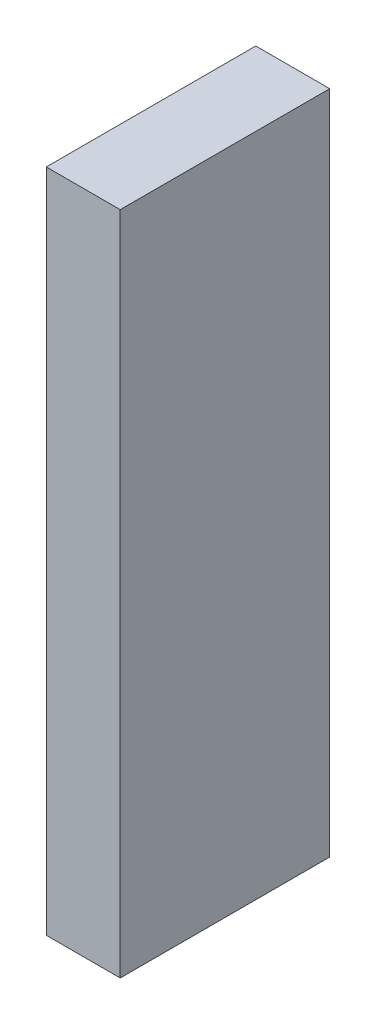
ISO-10303-21;
HEADER;
FILE_DESCRIPTION(('STEP AP214'),'2;1');
FILE_NAME('part.step','',(''),(''),'','','');
FILE_SCHEMA(('AUTOMOTIVE_DESIGN { 1 0 10303 214 1 1 1 1 }'));
ENDSEC;
DATA;
#1=APPLICATION_CONTEXT('core data for automotive mechanical design processes');
#2=APPLICATION_PROTOCOL_DEFINITION('international standard','automotive_design',2000,#1);
#3=PRODUCT_CONTEXT('',#1,'mechanical');
#4=PRODUCT('Part','Part','',(#3));
#5=PRODUCT_RELATED_PRODUCT_CATEGORY('part','',(#4));
#6=PRODUCT_DEFINITION_FORMATION('','',#4);
#7=PRODUCT_DEFINITION_CONTEXT('part definition',#1,'design');
#8=PRODUCT_DEFINITION('design','',#6,#7);
#9=PRODUCT_DEFINITION_SHAPE('','',#8);
#10=(LENGTH_UNIT() NAMED_UNIT(*) SI_UNIT(.MILLI.,.METRE.));
#11=(NAMED_UNIT(*) PLANE_ANGLE_UNIT() SI_UNIT($,.RADIAN.));
#12=(NAMED_UNIT(*) SI_UNIT($,.STERADIAN.) SOLID_ANGLE_UNIT());
#13=UNCERTAINTY_MEASURE_WITH_UNIT(LENGTH_MEASURE(1.E-05),#10,'distance_accuracy_value','');
#14=(GEOMETRIC_REPRESENTATION_CONTEXT(3) GLOBAL_UNCERTAINTY_ASSIGNED_CONTEXT((#13)) GLOBAL_UNIT_ASSIGNED_CONTEXT((#10,
#11,#12)) REPRESENTATION_CONTEXT('',''));
#15=CARTESIAN_POINT('',(0.,0.,0.));
#16=DIRECTION('',(0.,0.,1.));
#17=DIRECTION('',(1.,0.,0.));
#18=AXIS2_PLACEMENT_3D('',#15,#16,#17);
#19=CARTESIAN_POINT('',(-3.04999968745086,2.70001302776114,0.));
#20=DIRECTION('',(-1.,1.19248806385031E-08,0.));
#21=DIRECTION('',(-1.19248806385031E-08,-1.,0.));
#22=AXIS2_PLACEMENT_3D('',#19,#20,#21);
#23=PLANE('',#22);
#24=DIRECTION('',(-1.19248806627069E-08,-1.,0.));
#25=VECTOR('',#24,1.);
#26=CARTESIAN_POINT('',(-3.04999968745086,2.70001302776114,0.));
#27=LINE('',#26,#25);
#28=CARTESIAN_POINT('',(-3.04999968745086,2.70001302776114,0.));
#29=VERTEX_POINT('',#28);
#30=CARTESIAN_POINT('',(-3.04999975184515,-2.69998086872323,0.));
#31=VERTEX_POINT('',#30);
#32=EDGE_CURVE('E11',#29,#31,#27,.T.);
#33=ORIENTED_EDGE('',*,*,#32,.T.);
#34=DIRECTION('',(0.,0.,1.));
#35=VECTOR('',#34,1.);
#36=CARTESIAN_POINT('',(-3.04999975184515,-2.69998086872323,0.));
#37=LINE('',#36,#35);
#38=CARTESIAN_POINT('',(-3.04999975184515,-2.69998086872323,1.6999990940094));
#39=VERTEX_POINT('',#38);
#40=EDGE_CURVE('E88',#31,#39,#37,.T.);
#41=ORIENTED_EDGE('',*,*,#40,.T.);
#42=DIRECTION('',(-1.19248806627069E-08,-1.,0.));
#43=VECTOR('',#42,1.);
#44=CARTESIAN_POINT('',(-3.04999968745086,2.70001302776114,1.6999990940094));
#45=LINE('',#44,#43);
#46=CARTESIAN_POINT('',(-3.04999968745086,2.70001302776114,1.6999990940094));
#47=VERTEX_POINT('',#46);
#48=EDGE_CURVE('E83',#47,#39,#45,.T.);
#49=ORIENTED_EDGE('',*,*,#48,.F.);
#50=DIRECTION('',(0.,0.,1.));
#51=VECTOR('',#50,1.);
#52=CARTESIAN_POINT('',(-3.04999968745086,2.70001302776112,0.));
#53=LINE('',#52,#51);
#54=EDGE_CURVE('E72',#29,#47,#53,.T.);
#55=ORIENTED_EDGE('',*,*,#54,.F.);
#56=EDGE_LOOP('',(#33,#41,#49,#55));
#57=FACE_BOUND('',#56,.T.);
#58=ADVANCED_FACE('F17',(#57),#23,.T.);
#59=CARTESIAN_POINT('',(-3.04999975184515,-2.69998086872323,0.));
#60=DIRECTION('',(-1.19248806385031E-08,-1.,0.));
#61=DIRECTION('',(1.,-1.19248806385031E-08,0.));
#62=AXIS2_PLACEMENT_3D('',#59,#60,#61);
#63=PLANE('',#62);
#64=DIRECTION('',(1.,-1.19248803228865E-08,0.));
#65=VECTOR('',#64,1.);
#66=CARTESIAN_POINT('',(-3.04999975184515,-2.69998086872323,0.));
#67=LINE('',#66,#65);
#68=CARTESIAN_POINT('',(-2.45000127772406,-2.69998087587817,0.));
#69=VERTEX_POINT('',#68);
#70=EDGE_CURVE('E24',#31,#69,#67,.T.);
#71=ORIENTED_EDGE('',*,*,#70,.T.);
#72=DIRECTION('',(0.,0.,1.));
#73=VECTOR('',#72,1.);
#74=CARTESIAN_POINT('',(-2.45000127772406,-2.69998087587814,0.));
#75=LINE('',#74,#73);
#76=CARTESIAN_POINT('',(-2.45000127772406,-2.69998087587817,1.6999990940094));
#77=VERTEX_POINT('',#76);
#78=EDGE_CURVE('E85',#69,#77,#75,.T.);
#79=ORIENTED_EDGE('',*,*,#78,.T.);
#80=DIRECTION('',(1.,-1.19248803228865E-08,0.));
#81=VECTOR('',#80,1.);
#82=CARTESIAN_POINT('',(-3.04999975184515,-2.69998086872323,1.6999990940094));
#83=LINE('',#82,#81);
#84=EDGE_CURVE('E66',#39,#77,#83,.T.);
#85=ORIENTED_EDGE('',*,*,#84,.F.);
#86=ORIENTED_EDGE('',*,*,#40,.F.);
#87=EDGE_LOOP('',(#71,#79,#85,#86));
#88=FACE_BOUND('',#87,.T.);
#89=ADVANCED_FACE('F89',(#88),#63,.T.);
#90=CARTESIAN_POINT('',(-2.45000127772406,-2.69998087587817,0.));
#91=DIRECTION('',(1.,-1.19248806385031E-08,0.));
#92=DIRECTION('',(1.19248806385031E-08,1.,0.));
#93=AXIS2_PLACEMENT_3D('',#90,#91,#92);
#94=PLANE('',#93);
#95=DIRECTION('',(1.19248806627069E-08,1.,0.));
#96=VECTOR('',#95,1.);
#97=CARTESIAN_POINT('',(-2.45000127772406,-2.69998087587817,0.));
#98=LINE('',#97,#96);
#99=CARTESIAN_POINT('',(-2.45000121332977,2.70001302060621,0.));
#100=VERTEX_POINT('',#99);
#101=EDGE_CURVE('E62',#69,#100,#98,.T.);
#102=ORIENTED_EDGE('',*,*,#101,.T.);
#103=DIRECTION('',(0.,0.,1.));
#104=VECTOR('',#103,1.);
#105=CARTESIAN_POINT('',(-2.45000121332977,2.70001302060621,0.));
#106=LINE('',#105,#104);
#107=CARTESIAN_POINT('',(-2.45000121332977,2.70001302060621,1.6999990940094));
#108=VERTEX_POINT('',#107);
#109=EDGE_CURVE('E55',#100,#108,#106,.T.);
#110=ORIENTED_EDGE('',*,*,#109,.T.);
#111=DIRECTION('',(1.19248806627069E-08,1.,0.));
#112=VECTOR('',#111,1.);
#113=CARTESIAN_POINT('',(-2.45000127772406,-2.69998087587817,1.6999990940094));
#114=LINE('',#113,#112);
#115=EDGE_CURVE('E59',#77,#108,#114,.T.);
#116=ORIENTED_EDGE('',*,*,#115,.F.);
#117=ORIENTED_EDGE('',*,*,#78,.F.);
#118=EDGE_LOOP('',(#102,#110,#116,#117));
#119=FACE_BOUND('',#118,.T.);
#120=ADVANCED_FACE('F57',(#119),#94,.T.);
#121=CARTESIAN_POINT('',(-2.45000121332977,2.70001302060621,0.));
#122=DIRECTION('',(1.19248806385031E-08,1.,0.));
#123=DIRECTION('',(-1.,1.19248806385031E-08,0.));
#124=AXIS2_PLACEMENT_3D('',#121,#122,#123);
#125=PLANE('',#124);
#126=DIRECTION('',(-1.,1.19248803228865E-08,0.));
#127=VECTOR('',#126,1.);
#128=CARTESIAN_POINT('',(-2.45000121332977,2.70001302060621,0.));
#129=LINE('',#128,#127);
#130=EDGE_CURVE('E65',#100,#29,#129,.T.);
#131=ORIENTED_EDGE('',*,*,#130,.T.);
#132=ORIENTED_EDGE('',*,*,#54,.T.);
#133=DIRECTION('',(-1.,1.19248803228865E-08,0.));
#134=VECTOR('',#133,1.);
#135=CARTESIAN_POINT('',(-2.45000121332977,2.70001302060621,1.6999990940094));
#136=LINE('',#135,#134);
#137=EDGE_CURVE('E70',#108,#47,#136,.T.);
#138=ORIENTED_EDGE('',*,*,#137,.F.);
#139=ORIENTED_EDGE('',*,*,#109,.F.);
#140=EDGE_LOOP('',(#131,#132,#138,#139));
#141=FACE_BOUND('',#140,.T.);
#142=ADVANCED_FACE('F71',(#141),#125,.T.);
#143=CARTESIAN_POINT('',(65.7749938964844,-279.424987792969,1.6999990940094));
#144=DIRECTION('',(0.,0.,1.));
#145=DIRECTION('',(1.19248806385031E-08,1.,0.));
#146=AXIS2_PLACEMENT_3D('',#143,#144,#145);
#147=PLANE('',#146);
#148=ORIENTED_EDGE('',*,*,#48,.T.);
#149=ORIENTED_EDGE('',*,*,#84,.T.);
#150=ORIENTED_EDGE('',*,*,#115,.T.);
#151=ORIENTED_EDGE('',*,*,#137,.T.);
#152=EDGE_LOOP('',(#148,#149,#150,#151));
#153=FACE_BOUND('',#152,.T.);
#154=ADVANCED_FACE('F76',(#153),#147,.T.);
#155=CARTESIAN_POINT('',(65.7749938964844,-279.424987792969,0.));
#156=DIRECTION('',(0.,0.,1.));
#157=DIRECTION('',(1.19248806385031E-08,1.,0.));
#158=AXIS2_PLACEMENT_3D('',#155,#156,#157);
#159=PLANE('',#158);
#160=ORIENTED_EDGE('',*,*,#130,.F.);
#161=ORIENTED_EDGE('',*,*,#101,.F.);
#162=ORIENTED_EDGE('',*,*,#70,.F.);
#163=ORIENTED_EDGE('',*,*,#32,.F.);
#164=EDGE_LOOP('',(#160,#161,#162,#163));
#165=FACE_BOUND('',#164,.T.);
#166=ADVANCED_FACE('F91',(#165),#159,.F.);
#167=CLOSED_SHELL('',(#58,#89,#120,#142,#154,#166));
#168=MANIFOLD_SOLID_BREP('B1',#167);
#169=ADVANCED_BREP_SHAPE_REPRESENTATION('',(#18,#168),#14);
#170=SHAPE_DEFINITION_REPRESENTATION(#9,#169);
ENDSEC;
END-ISO-10303-21;
